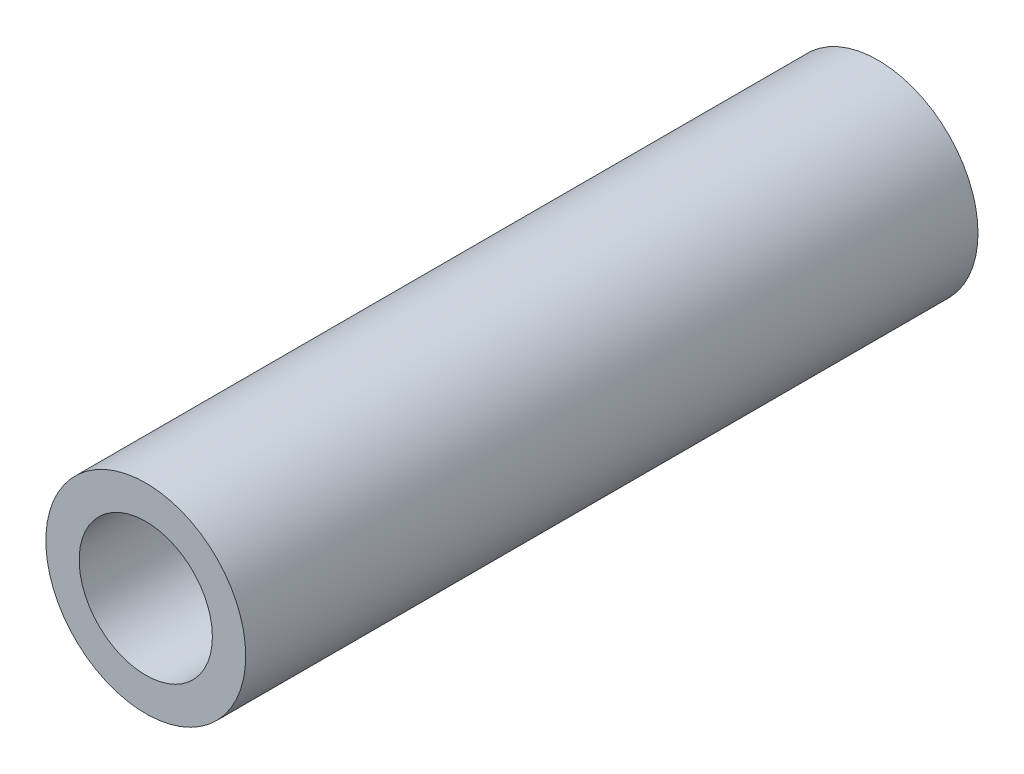
ISO-10303-21;
HEADER;
FILE_DESCRIPTION(('STEP AP214'),'2;1');
FILE_NAME('part.step','',(''),(''),'','','');
FILE_SCHEMA(('AUTOMOTIVE_DESIGN { 1 0 10303 214 1 1 1 1 }'));
ENDSEC;
DATA;
#1=APPLICATION_CONTEXT('core data for automotive mechanical design processes');
#2=APPLICATION_PROTOCOL_DEFINITION('international standard','automotive_design',2000,#1);
#3=PRODUCT_CONTEXT('',#1,'mechanical');
#4=PRODUCT('Part','Part','',(#3));
#5=PRODUCT_RELATED_PRODUCT_CATEGORY('part','',(#4));
#6=PRODUCT_DEFINITION_FORMATION('','',#4);
#7=PRODUCT_DEFINITION_CONTEXT('part definition',#1,'design');
#8=PRODUCT_DEFINITION('design','',#6,#7);
#9=PRODUCT_DEFINITION_SHAPE('','',#8);
#10=(LENGTH_UNIT() NAMED_UNIT(*) SI_UNIT(.MILLI.,.METRE.));
#11=(NAMED_UNIT(*) PLANE_ANGLE_UNIT() SI_UNIT($,.RADIAN.));
#12=(NAMED_UNIT(*) SI_UNIT($,.STERADIAN.) SOLID_ANGLE_UNIT());
#13=UNCERTAINTY_MEASURE_WITH_UNIT(LENGTH_MEASURE(1.E-05),#10,'distance_accuracy_value','');
#14=(GEOMETRIC_REPRESENTATION_CONTEXT(3) GLOBAL_UNCERTAINTY_ASSIGNED_CONTEXT((#13)) GLOBAL_UNIT_ASSIGNED_CONTEXT((#10,
#11,#12)) REPRESENTATION_CONTEXT('',''));
#15=CARTESIAN_POINT('',(0.,0.,0.));
#16=DIRECTION('',(0.,0.,1.));
#17=DIRECTION('',(1.,0.,0.));
#18=AXIS2_PLACEMENT_3D('',#15,#16,#17);
#19=CARTESIAN_POINT('',(0.,0.,-8.7249));
#20=DIRECTION('',(0.,0.,1.));
#21=DIRECTION('',(1.,0.,0.));
#22=AXIS2_PLACEMENT_3D('',#19,#20,#21);
#23=CYLINDRICAL_SURFACE('',#22,2.38125);
#24=CARTESIAN_POINT('',(0.,0.,-8.7249));
#25=DIRECTION('',(0.,0.,1.));
#26=DIRECTION('',(1.,0.,0.));
#27=AXIS2_PLACEMENT_3D('',#24,#25,#26);
#28=CIRCLE('',#27,2.38125);
#29=CARTESIAN_POINT('',(2.38125,0.,-8.7249));
#30=VERTEX_POINT('',#29);
#31=EDGE_CURVE('E10',#30,#30,#28,.T.);
#32=ORIENTED_EDGE('',*,*,#31,.T.);
#33=EDGE_LOOP('',(#32));
#34=FACE_BOUND('',#33,.T.);
#35=CARTESIAN_POINT('',(0.,0.,8.7249));
#36=DIRECTION('',(0.,0.,1.));
#37=DIRECTION('',(1.,0.,0.));
#38=AXIS2_PLACEMENT_3D('',#35,#36,#37);
#39=CIRCLE('',#38,2.38125);
#40=CARTESIAN_POINT('',(2.38125,0.,8.7249));
#41=VERTEX_POINT('',#40);
#42=EDGE_CURVE('E40',#41,#41,#39,.T.);
#43=ORIENTED_EDGE('',*,*,#42,.F.);
#44=EDGE_LOOP('',(#43));
#45=FACE_BOUND('',#44,.T.);
#46=ADVANCED_FACE('F37',(#34,#45),#23,.T.);
#47=CARTESIAN_POINT('',(0.,0.,-8.7249));
#48=DIRECTION('',(0.,0.,1.));
#49=DIRECTION('',(1.,0.,0.));
#50=AXIS2_PLACEMENT_3D('',#47,#48,#49);
#51=PLANE('',#50);
#52=CARTESIAN_POINT('',(0.,0.,-8.7249));
#53=DIRECTION('',(0.,0.,1.));
#54=DIRECTION('',(1.,0.,0.));
#55=AXIS2_PLACEMENT_3D('',#52,#53,#54);
#56=CIRCLE('',#55,1.5875);
#57=CARTESIAN_POINT('',(1.5875,0.,-8.7249));
#58=VERTEX_POINT('',#57);
#59=EDGE_CURVE('E47',#58,#58,#56,.F.);
#60=ORIENTED_EDGE('',*,*,#59,.F.);
#61=EDGE_LOOP('',(#60));
#62=FACE_BOUND('',#61,.T.);
#63=ORIENTED_EDGE('',*,*,#31,.F.);
#64=EDGE_LOOP('',(#63));
#65=FACE_BOUND('',#64,.T.);
#66=ADVANCED_FACE('F61',(#62,#65),#51,.F.);
#67=CARTESIAN_POINT('',(0.,0.,8.7249));
#68=DIRECTION('',(0.,0.,1.));
#69=DIRECTION('',(1.,0.,0.));
#70=AXIS2_PLACEMENT_3D('',#67,#68,#69);
#71=PLANE('',#70);
#72=CARTESIAN_POINT('',(0.,0.,8.7249));
#73=DIRECTION('',(0.,0.,1.));
#74=DIRECTION('',(1.,0.,0.));
#75=AXIS2_PLACEMENT_3D('',#72,#73,#74);
#76=CIRCLE('',#75,1.5875);
#77=CARTESIAN_POINT('',(1.5875,0.,8.7249));
#78=VERTEX_POINT('',#77);
#79=EDGE_CURVE('E51',#78,#78,#76,.T.);
#80=ORIENTED_EDGE('',*,*,#79,.F.);
#81=EDGE_LOOP('',(#80));
#82=FACE_BOUND('',#81,.T.);
#83=ORIENTED_EDGE('',*,*,#42,.T.);
#84=EDGE_LOOP('',(#83));
#85=FACE_BOUND('',#84,.T.);
#86=ADVANCED_FACE('F58',(#82,#85),#71,.T.);
#87=CARTESIAN_POINT('',(0.,0.,-8.7259));
#88=DIRECTION('',(0.,0.,1.));
#89=DIRECTION('',(1.,0.,0.));
#90=AXIS2_PLACEMENT_3D('',#87,#88,#89);
#91=CYLINDRICAL_SURFACE('',#90,1.5875);
#92=ORIENTED_EDGE('',*,*,#79,.T.);
#93=EDGE_LOOP('',(#92));
#94=FACE_BOUND('',#93,.T.);
#95=ORIENTED_EDGE('',*,*,#59,.T.);
#96=EDGE_LOOP('',(#95));
#97=FACE_BOUND('',#96,.T.);
#98=ADVANCED_FACE('F55',(#94,#97),#91,.F.);
#99=CLOSED_SHELL('',(#46,#66,#86,#98));
#100=MANIFOLD_SOLID_BREP('B2',#99);
#101=ADVANCED_BREP_SHAPE_REPRESENTATION('',(#18,#100),#14);
#102=SHAPE_DEFINITION_REPRESENTATION(#9,#101);
ENDSEC;
END-ISO-10303-21;
